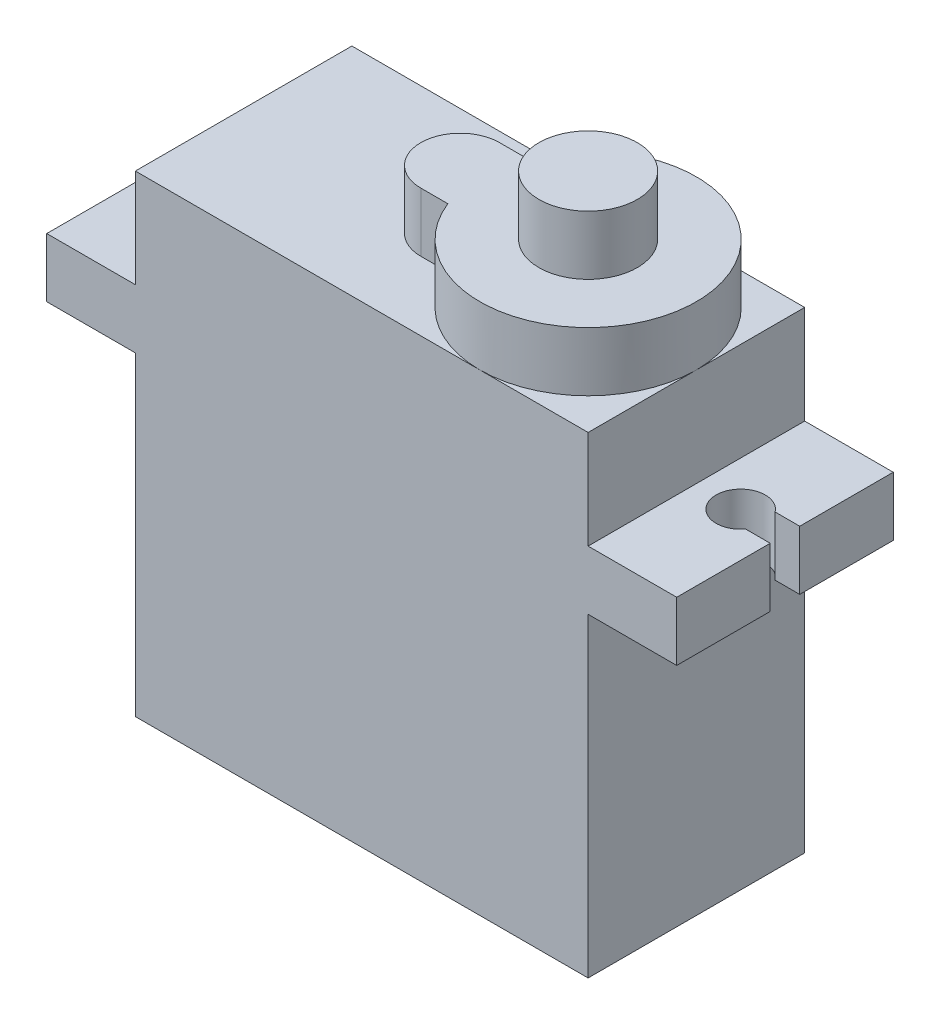
ISO-10303-21;
HEADER;
FILE_DESCRIPTION(('STEP AP214'),'2;1');
FILE_NAME('part.step','',(''),(''),'','','');
FILE_SCHEMA(('AUTOMOTIVE_DESIGN { 1 0 10303 214 1 1 1 1 }'));
ENDSEC;
DATA;
#1=APPLICATION_CONTEXT('core data for automotive mechanical design processes');
#2=APPLICATION_PROTOCOL_DEFINITION('international standard','automotive_design',2000,#1);
#3=PRODUCT_CONTEXT('',#1,'mechanical');
#4=PRODUCT('Part','Part','',(#3));
#5=PRODUCT_RELATED_PRODUCT_CATEGORY('part','',(#4));
#6=PRODUCT_DEFINITION_FORMATION('','',#4);
#7=PRODUCT_DEFINITION_CONTEXT('part definition',#1,'design');
#8=PRODUCT_DEFINITION('design','',#6,#7);
#9=PRODUCT_DEFINITION_SHAPE('','',#8);
#10=(LENGTH_UNIT() NAMED_UNIT(*) SI_UNIT(.MILLI.,.METRE.));
#11=(NAMED_UNIT(*) PLANE_ANGLE_UNIT() SI_UNIT($,.RADIAN.));
#12=(NAMED_UNIT(*) SI_UNIT($,.STERADIAN.) SOLID_ANGLE_UNIT());
#13=UNCERTAINTY_MEASURE_WITH_UNIT(LENGTH_MEASURE(1.E-05),#10,'distance_accuracy_value','');
#14=(GEOMETRIC_REPRESENTATION_CONTEXT(3) GLOBAL_UNCERTAINTY_ASSIGNED_CONTEXT((#13)) GLOBAL_UNIT_ASSIGNED_CONTEXT((#10,
#11,#12)) REPRESENTATION_CONTEXT('',''));
#15=CARTESIAN_POINT('',(0.,0.,0.));
#16=DIRECTION('',(0.,0.,1.));
#17=DIRECTION('',(1.,0.,0.));
#18=AXIS2_PLACEMENT_3D('',#15,#16,#17);
#19=CARTESIAN_POINT('',(-16.,0.,0.));
#20=DIRECTION('',(1.,0.,0.));
#21=DIRECTION('',(0.,0.,-1.));
#22=AXIS2_PLACEMENT_3D('',#19,#20,#21);
#23=PLANE('',#22);
#24=DIRECTION('',(0.,0.,-1.));
#25=VECTOR('',#24,1.);
#26=CARTESIAN_POINT('',(-16.,16.,5.5));
#27=LINE('',#26,#25);
#28=CARTESIAN_POINT('',(-16.,16.,-0.75));
#29=VERTEX_POINT('',#28);
#30=CARTESIAN_POINT('',(-16.,16.,-5.5));
#31=VERTEX_POINT('',#30);
#32=EDGE_CURVE('E309',#29,#31,#27,.T.);
#33=ORIENTED_EDGE('',*,*,#32,.F.);
#34=DIRECTION('',(0.,1.,0.));
#35=VECTOR('',#34,1.);
#36=CARTESIAN_POINT('',(-16.,15.,-0.75));
#37=LINE('',#36,#35);
#38=CARTESIAN_POINT('',(-16.,19.,-0.75));
#39=VERTEX_POINT('',#38);
#40=EDGE_CURVE('E227',#29,#39,#37,.T.);
#41=ORIENTED_EDGE('',*,*,#40,.T.);
#42=DIRECTION('',(0.,0.,1.));
#43=VECTOR('',#42,1.);
#44=CARTESIAN_POINT('',(-16.,19.,5.5));
#45=LINE('',#44,#43);
#46=CARTESIAN_POINT('',(-16.,19.,-5.5));
#47=VERTEX_POINT('',#46);
#48=EDGE_CURVE('E317',#47,#39,#45,.T.);
#49=ORIENTED_EDGE('',*,*,#48,.F.);
#50=DIRECTION('',(0.,1.,0.));
#51=VECTOR('',#50,1.);
#52=CARTESIAN_POINT('',(-16.,19.,-5.5));
#53=LINE('',#52,#51);
#54=EDGE_CURVE('E313',#31,#47,#53,.T.);
#55=ORIENTED_EDGE('',*,*,#54,.F.);
#56=EDGE_LOOP('',(#33,#41,#49,#55));
#57=FACE_BOUND('',#56,.T.);
#58=ADVANCED_FACE('F34',(#57),#23,.F.);
#59=CARTESIAN_POINT('',(16.,0.,0.));
#60=DIRECTION('',(1.,0.,0.));
#61=DIRECTION('',(0.,0.,-1.));
#62=AXIS2_PLACEMENT_3D('',#59,#60,#61);
#63=PLANE('',#62);
#64=DIRECTION('',(0.,1.,0.));
#65=VECTOR('',#64,1.);
#66=CARTESIAN_POINT('',(16.,0.,-0.75));
#67=LINE('',#66,#65);
#68=CARTESIAN_POINT('',(16.,16.,-0.75));
#69=VERTEX_POINT('',#68);
#70=CARTESIAN_POINT('',(16.,19.,-0.75));
#71=VERTEX_POINT('',#70);
#72=EDGE_CURVE('E42',#69,#71,#67,.T.);
#73=ORIENTED_EDGE('',*,*,#72,.F.);
#74=DIRECTION('',(0.,0.,-1.));
#75=VECTOR('',#74,1.);
#76=CARTESIAN_POINT('',(16.,16.,5.5));
#77=LINE('',#76,#75);
#78=CARTESIAN_POINT('',(16.,16.,-5.5));
#79=VERTEX_POINT('',#78);
#80=EDGE_CURVE('E295',#69,#79,#77,.T.);
#81=ORIENTED_EDGE('',*,*,#80,.T.);
#82=DIRECTION('',(0.,1.,0.));
#83=VECTOR('',#82,1.);
#84=CARTESIAN_POINT('',(16.,19.,-5.5));
#85=LINE('',#84,#83);
#86=CARTESIAN_POINT('',(16.,19.,-5.5));
#87=VERTEX_POINT('',#86);
#88=EDGE_CURVE('E299',#79,#87,#85,.T.);
#89=ORIENTED_EDGE('',*,*,#88,.T.);
#90=DIRECTION('',(0.,0.,1.));
#91=VECTOR('',#90,1.);
#92=CARTESIAN_POINT('',(16.,19.,5.5));
#93=LINE('',#92,#91);
#94=EDGE_CURVE('E303',#87,#71,#93,.T.);
#95=ORIENTED_EDGE('',*,*,#94,.T.);
#96=EDGE_LOOP('',(#73,#81,#89,#95));
#97=FACE_BOUND('',#96,.T.);
#98=ADVANCED_FACE('F400',(#97),#63,.T.);
#99=CARTESIAN_POINT('',(0.,24.,0.));
#100=DIRECTION('',(0.,-1.,0.));
#101=DIRECTION('',(0.,0.,-1.));
#102=AXIS2_PLACEMENT_3D('',#99,#100,#101);
#103=PLANE('',#102);
#104=CARTESIAN_POINT('',(6.,24.,0.));
#105=DIRECTION('',(0.,1.,0.));
#106=DIRECTION('',(0.,0.,1.));
#107=AXIS2_PLACEMENT_3D('',#104,#105,#106);
#108=CIRCLE('',#107,5.5);
#109=CARTESIAN_POINT('',(11.5,24.,0.));
#110=VERTEX_POINT('',#109);
#111=CARTESIAN_POINT('',(6.,24.,-5.5));
#112=VERTEX_POINT('',#111);
#113=EDGE_CURVE('E277',#110,#112,#108,.T.);
#114=ORIENTED_EDGE('',*,*,#113,.F.);
#115=DIRECTION('',(0.,0.,-1.));
#116=VECTOR('',#115,1.);
#117=CARTESIAN_POINT('',(11.5,24.,5.5));
#118=LINE('',#117,#116);
#119=CARTESIAN_POINT('',(11.5,24.,-5.5));
#120=VERTEX_POINT('',#119);
#121=EDGE_CURVE('E350',#110,#120,#118,.T.);
#122=ORIENTED_EDGE('',*,*,#121,.T.);
#123=DIRECTION('',(-1.,0.,0.));
#124=VECTOR('',#123,1.);
#125=CARTESIAN_POINT('',(-11.5,24.,-5.5));
#126=LINE('',#125,#124);
#127=EDGE_CURVE('E351',#120,#112,#126,.T.);
#128=ORIENTED_EDGE('',*,*,#127,.T.);
#129=EDGE_LOOP('',(#114,#122,#128));
#130=FACE_BOUND('',#129,.T.);
#131=ADVANCED_FACE('F454',(#130),#103,.F.);
#132=CARTESIAN_POINT('',(0.876524617020201,24.,-2.));
#133=VERTEX_POINT('',#132);
#134=EDGE_CURVE('E520',#112,#133,#108,.T.);
#135=ORIENTED_EDGE('',*,*,#134,.F.);
#136=CARTESIAN_POINT('',(-11.5,24.,-5.5));
#137=VERTEX_POINT('',#136);
#138=EDGE_CURVE('E349',#112,#137,#126,.T.);
#139=ORIENTED_EDGE('',*,*,#138,.T.);
#140=DIRECTION('',(0.,0.,1.));
#141=VECTOR('',#140,1.);
#142=CARTESIAN_POINT('',(-11.5,24.,5.5));
#143=LINE('',#142,#141);
#144=CARTESIAN_POINT('',(-11.5,24.,5.5));
#145=VERTEX_POINT('',#144);
#146=EDGE_CURVE('E354',#137,#145,#143,.T.);
#147=ORIENTED_EDGE('',*,*,#146,.T.);
#148=DIRECTION('',(1.,0.,0.));
#149=VECTOR('',#148,1.);
#150=CARTESIAN_POINT('',(-11.5,24.,5.5));
#151=LINE('',#150,#149);
#152=CARTESIAN_POINT('',(6.,24.,5.5));
#153=VERTEX_POINT('',#152);
#154=EDGE_CURVE('E357',#145,#153,#151,.T.);
#155=ORIENTED_EDGE('',*,*,#154,.T.);
#156=CARTESIAN_POINT('',(0.876524617020201,24.,2.));
#157=VERTEX_POINT('',#156);
#158=EDGE_CURVE('E274',#157,#153,#108,.T.);
#159=ORIENTED_EDGE('',*,*,#158,.F.);
#160=DIRECTION('',(1.,0.,0.));
#161=VECTOR('',#160,1.);
#162=CARTESIAN_POINT('',(-0.5,24.,2.));
#163=LINE('',#162,#161);
#164=CARTESIAN_POINT('',(-0.5,24.,2.));
#165=VERTEX_POINT('',#164);
#166=EDGE_CURVE('E271',#165,#157,#163,.T.);
#167=ORIENTED_EDGE('',*,*,#166,.F.);
#168=CARTESIAN_POINT('',(-0.5,24.,0.));
#169=DIRECTION('',(0.,1.,0.));
#170=DIRECTION('',(0.,0.,1.));
#171=AXIS2_PLACEMENT_3D('',#168,#169,#170);
#172=CIRCLE('',#171,2.);
#173=CARTESIAN_POINT('',(-0.5,24.,-2.));
#174=VERTEX_POINT('',#173);
#175=EDGE_CURVE('E257',#174,#165,#172,.T.);
#176=ORIENTED_EDGE('',*,*,#175,.F.);
#177=DIRECTION('',(-1.,0.,0.));
#178=VECTOR('',#177,1.);
#179=CARTESIAN_POINT('',(-0.5,24.,-2.));
#180=LINE('',#179,#178);
#181=EDGE_CURVE('E262',#133,#174,#180,.T.);
#182=ORIENTED_EDGE('',*,*,#181,.F.);
#183=EDGE_LOOP('',(#135,#139,#147,#155,#159,#167,#176,#182));
#184=FACE_BOUND('',#183,.T.);
#185=ADVANCED_FACE('F501',(#184),#103,.F.);
#186=CARTESIAN_POINT('',(11.5,24.,5.5));
#187=DIRECTION('',(-1.,0.,0.));
#188=DIRECTION('',(0.,0.,1.));
#189=AXIS2_PLACEMENT_3D('',#186,#187,#188);
#190=PLANE('',#189);
#191=DIRECTION('',(0.,-1.,0.));
#192=VECTOR('',#191,1.);
#193=CARTESIAN_POINT('',(11.5,24.,5.5));
#194=LINE('',#193,#192);
#195=CARTESIAN_POINT('',(11.5,24.,5.5));
#196=VERTEX_POINT('',#195);
#197=CARTESIAN_POINT('',(11.5,19.,5.5));
#198=VERTEX_POINT('',#197);
#199=EDGE_CURVE('E372',#196,#198,#194,.T.);
#200=ORIENTED_EDGE('',*,*,#199,.T.);
#201=DIRECTION('',(0.,0.,-1.));
#202=VECTOR('',#201,1.);
#203=CARTESIAN_POINT('',(11.5,19.,5.5));
#204=LINE('',#203,#202);
#205=CARTESIAN_POINT('',(11.5,19.,-5.5));
#206=VERTEX_POINT('',#205);
#207=EDGE_CURVE('E342',#198,#206,#204,.T.);
#208=ORIENTED_EDGE('',*,*,#207,.T.);
#209=DIRECTION('',(0.,-1.,0.));
#210=VECTOR('',#209,1.);
#211=CARTESIAN_POINT('',(11.5,24.,-5.5));
#212=LINE('',#211,#210);
#213=EDGE_CURVE('E384',#120,#206,#212,.T.);
#214=ORIENTED_EDGE('',*,*,#213,.F.);
#215=ORIENTED_EDGE('',*,*,#121,.F.);
#216=EDGE_CURVE('E346',#196,#110,#118,.T.);
#217=ORIENTED_EDGE('',*,*,#216,.F.);
#218=EDGE_LOOP('',(#200,#208,#214,#215,#217));
#219=FACE_BOUND('',#218,.T.);
#220=ADVANCED_FACE('F413',(#219),#190,.F.);
#221=CARTESIAN_POINT('',(-11.5,24.,5.5));
#222=DIRECTION('',(1.,0.,0.));
#223=DIRECTION('',(0.,0.,-1.));
#224=AXIS2_PLACEMENT_3D('',#221,#222,#223);
#225=PLANE('',#224);
#226=DIRECTION('',(0.,-1.,0.));
#227=VECTOR('',#226,1.);
#228=CARTESIAN_POINT('',(-11.5,24.,-5.5));
#229=LINE('',#228,#227);
#230=CARTESIAN_POINT('',(-11.5,19.,-5.5));
#231=VERTEX_POINT('',#230);
#232=EDGE_CURVE('E380',#137,#231,#229,.T.);
#233=ORIENTED_EDGE('',*,*,#232,.T.);
#234=DIRECTION('',(0.,0.,1.));
#235=VECTOR('',#234,1.);
#236=CARTESIAN_POINT('',(-11.5,19.,5.5));
#237=LINE('',#236,#235);
#238=CARTESIAN_POINT('',(-11.5,19.,5.5));
#239=VERTEX_POINT('',#238);
#240=EDGE_CURVE('E339',#231,#239,#237,.T.);
#241=ORIENTED_EDGE('',*,*,#240,.T.);
#242=DIRECTION('',(0.,-1.,0.));
#243=VECTOR('',#242,1.);
#244=CARTESIAN_POINT('',(-11.5,24.,5.5));
#245=LINE('',#244,#243);
#246=EDGE_CURVE('E376',#145,#239,#245,.T.);
#247=ORIENTED_EDGE('',*,*,#246,.F.);
#248=ORIENTED_EDGE('',*,*,#146,.F.);
#249=EDGE_LOOP('',(#233,#241,#247,#248));
#250=FACE_BOUND('',#249,.T.);
#251=ADVANCED_FACE('F477',(#250),#225,.F.);
#252=CARTESIAN_POINT('',(11.5,16.,-5.5));
#253=VERTEX_POINT('',#252);
#254=CARTESIAN_POINT('',(11.5,0.,-5.5));
#255=VERTEX_POINT('',#254);
#256=EDGE_CURVE('E383',#253,#255,#212,.T.);
#257=ORIENTED_EDGE('',*,*,#256,.F.);
#258=DIRECTION('',(0.,0.,1.));
#259=VECTOR('',#258,1.);
#260=CARTESIAN_POINT('',(11.5,16.,5.5));
#261=LINE('',#260,#259);
#262=CARTESIAN_POINT('',(11.5,16.,5.5));
#263=VERTEX_POINT('',#262);
#264=EDGE_CURVE('E336',#253,#263,#261,.T.);
#265=ORIENTED_EDGE('',*,*,#264,.T.);
#266=CARTESIAN_POINT('',(11.5,0.,5.5));
#267=VERTEX_POINT('',#266);
#268=EDGE_CURVE('E360',#263,#267,#194,.T.);
#269=ORIENTED_EDGE('',*,*,#268,.T.);
#270=DIRECTION('',(0.,0.,-1.));
#271=VECTOR('',#270,1.);
#272=CARTESIAN_POINT('',(11.5,0.,5.5));
#273=LINE('',#272,#271);
#274=EDGE_CURVE('E345',#267,#255,#273,.T.);
#275=ORIENTED_EDGE('',*,*,#274,.T.);
#276=EDGE_LOOP('',(#257,#265,#269,#275));
#277=FACE_BOUND('',#276,.T.);
#278=ADVANCED_FACE('F36',(#277),#190,.F.);
#279=CARTESIAN_POINT('',(-11.5,24.,-5.5));
#280=DIRECTION('',(0.,0.,1.));
#281=DIRECTION('',(1.,0.,0.));
#282=AXIS2_PLACEMENT_3D('',#279,#280,#281);
#283=PLANE('',#282);
#284=CARTESIAN_POINT('',(-11.5,16.,-5.5));
#285=VERTEX_POINT('',#284);
#286=CARTESIAN_POINT('',(-11.5,0.,-5.5));
#287=VERTEX_POINT('',#286);
#288=EDGE_CURVE('E379',#285,#287,#229,.T.);
#289=ORIENTED_EDGE('',*,*,#288,.F.);
#290=DIRECTION('',(1.,0.,0.));
#291=VECTOR('',#290,1.);
#292=CARTESIAN_POINT('',(-16.,16.,-5.5));
#293=LINE('',#292,#291);
#294=EDGE_CURVE('E328',#31,#285,#293,.T.);
#295=ORIENTED_EDGE('',*,*,#294,.F.);
#296=ORIENTED_EDGE('',*,*,#54,.T.);
#297=DIRECTION('',(1.,0.,0.));
#298=VECTOR('',#297,1.);
#299=CARTESIAN_POINT('',(-16.,19.,-5.5));
#300=LINE('',#299,#298);
#301=EDGE_CURVE('E324',#47,#231,#300,.T.);
#302=ORIENTED_EDGE('',*,*,#301,.T.);
#303=ORIENTED_EDGE('',*,*,#232,.F.);
#304=ORIENTED_EDGE('',*,*,#138,.F.);
#305=ORIENTED_EDGE('',*,*,#127,.F.);
#306=ORIENTED_EDGE('',*,*,#213,.T.);
#307=EDGE_CURVE('E327',#206,#87,#300,.T.);
#308=ORIENTED_EDGE('',*,*,#307,.T.);
#309=ORIENTED_EDGE('',*,*,#88,.F.);
#310=EDGE_CURVE('E330',#253,#79,#293,.T.);
#311=ORIENTED_EDGE('',*,*,#310,.F.);
#312=ORIENTED_EDGE('',*,*,#256,.T.);
#313=DIRECTION('',(-1.,0.,0.));
#314=VECTOR('',#313,1.);
#315=CARTESIAN_POINT('',(-11.5,0.,-5.5));
#316=LINE('',#315,#314);
#317=EDGE_CURVE('E363',#255,#287,#316,.T.);
#318=ORIENTED_EDGE('',*,*,#317,.T.);
#319=EDGE_LOOP('',(#289,#295,#296,#302,#303,#304,#305,#306,#308,#309,#311,#312,#318));
#320=FACE_BOUND('',#319,.T.);
#321=ADVANCED_FACE('F406',(#320),#283,.F.);
#322=CARTESIAN_POINT('',(-11.5,16.,5.5));
#323=VERTEX_POINT('',#322);
#324=CARTESIAN_POINT('',(-11.5,0.,5.5));
#325=VERTEX_POINT('',#324);
#326=EDGE_CURVE('E375',#323,#325,#245,.T.);
#327=ORIENTED_EDGE('',*,*,#326,.F.);
#328=DIRECTION('',(0.,0.,-1.));
#329=VECTOR('',#328,1.);
#330=CARTESIAN_POINT('',(-11.5,16.,5.5));
#331=LINE('',#330,#329);
#332=EDGE_CURVE('E322',#323,#285,#331,.T.);
#333=ORIENTED_EDGE('',*,*,#332,.T.);
#334=ORIENTED_EDGE('',*,*,#288,.T.);
#335=DIRECTION('',(0.,0.,1.));
#336=VECTOR('',#335,1.);
#337=CARTESIAN_POINT('',(-11.5,0.,5.5));
#338=LINE('',#337,#336);
#339=EDGE_CURVE('E366',#287,#325,#338,.T.);
#340=ORIENTED_EDGE('',*,*,#339,.T.);
#341=EDGE_LOOP('',(#327,#333,#334,#340));
#342=FACE_BOUND('',#341,.T.);
#343=ADVANCED_FACE('F488',(#342),#225,.F.);
#344=CARTESIAN_POINT('',(-11.5,24.,5.5));
#345=DIRECTION('',(0.,0.,-1.));
#346=DIRECTION('',(-1.,0.,0.));
#347=AXIS2_PLACEMENT_3D('',#344,#345,#346);
#348=PLANE('',#347);
#349=ORIENTED_EDGE('',*,*,#268,.F.);
#350=DIRECTION('',(1.,0.,0.));
#351=VECTOR('',#350,1.);
#352=CARTESIAN_POINT('',(-16.,16.,5.5));
#353=LINE('',#352,#351);
#354=CARTESIAN_POINT('',(16.,16.,5.5));
#355=VERTEX_POINT('',#354);
#356=EDGE_CURVE('E319',#263,#355,#353,.T.);
#357=ORIENTED_EDGE('',*,*,#356,.T.);
#358=DIRECTION('',(0.,-1.,0.));
#359=VECTOR('',#358,1.);
#360=CARTESIAN_POINT('',(16.,19.,5.5));
#361=LINE('',#360,#359);
#362=CARTESIAN_POINT('',(16.,19.,5.5));
#363=VERTEX_POINT('',#362);
#364=EDGE_CURVE('E292',#363,#355,#361,.T.);
#365=ORIENTED_EDGE('',*,*,#364,.F.);
#366=DIRECTION('',(1.,0.,0.));
#367=VECTOR('',#366,1.);
#368=CARTESIAN_POINT('',(-16.,19.,5.5));
#369=LINE('',#368,#367);
#370=EDGE_CURVE('E323',#198,#363,#369,.T.);
#371=ORIENTED_EDGE('',*,*,#370,.F.);
#372=ORIENTED_EDGE('',*,*,#199,.F.);
#373=EDGE_CURVE('E356',#153,#196,#151,.T.);
#374=ORIENTED_EDGE('',*,*,#373,.F.);
#375=ORIENTED_EDGE('',*,*,#154,.F.);
#376=ORIENTED_EDGE('',*,*,#246,.T.);
#377=CARTESIAN_POINT('',(-16.,19.,5.5));
#378=VERTEX_POINT('',#377);
#379=EDGE_CURVE('E320',#378,#239,#369,.T.);
#380=ORIENTED_EDGE('',*,*,#379,.F.);
#381=DIRECTION('',(0.,-1.,0.));
#382=VECTOR('',#381,1.);
#383=CARTESIAN_POINT('',(-16.,19.,5.5));
#384=LINE('',#383,#382);
#385=CARTESIAN_POINT('',(-16.,16.,5.5));
#386=VERTEX_POINT('',#385);
#387=EDGE_CURVE('E306',#378,#386,#384,.T.);
#388=ORIENTED_EDGE('',*,*,#387,.T.);
#389=EDGE_CURVE('E331',#386,#323,#353,.T.);
#390=ORIENTED_EDGE('',*,*,#389,.T.);
#391=ORIENTED_EDGE('',*,*,#326,.T.);
#392=DIRECTION('',(1.,0.,0.));
#393=VECTOR('',#392,1.);
#394=CARTESIAN_POINT('',(-11.5,0.,5.5));
#395=LINE('',#394,#393);
#396=EDGE_CURVE('E369',#325,#267,#395,.T.);
#397=ORIENTED_EDGE('',*,*,#396,.T.);
#398=EDGE_LOOP('',(#349,#357,#365,#371,#372,#374,#375,#376,#380,#388,#390,#391,#397));
#399=FACE_BOUND('',#398,.T.);
#400=ADVANCED_FACE('F420',(#399),#348,.F.);
#401=EDGE_CURVE('E278',#153,#110,#108,.T.);
#402=ORIENTED_EDGE('',*,*,#401,.F.);
#403=ORIENTED_EDGE('',*,*,#373,.T.);
#404=ORIENTED_EDGE('',*,*,#216,.T.);
#405=EDGE_LOOP('',(#402,#403,#404));
#406=FACE_BOUND('',#405,.T.);
#407=ADVANCED_FACE('F468',(#406),#103,.F.);
#408=CARTESIAN_POINT('',(0.,0.,0.));
#409=DIRECTION('',(0.,-1.,0.));
#410=DIRECTION('',(0.,0.,-1.));
#411=AXIS2_PLACEMENT_3D('',#408,#409,#410);
#412=PLANE('',#411);
#413=ORIENTED_EDGE('',*,*,#274,.F.);
#414=ORIENTED_EDGE('',*,*,#396,.F.);
#415=ORIENTED_EDGE('',*,*,#339,.F.);
#416=ORIENTED_EDGE('',*,*,#317,.F.);
#417=EDGE_LOOP('',(#413,#414,#415,#416));
#418=FACE_BOUND('',#417,.T.);
#419=ADVANCED_FACE('F460',(#418),#412,.T.);
#420=CARTESIAN_POINT('',(-16.,19.,0.75));
#421=VERTEX_POINT('',#420);
#422=EDGE_CURVE('E316',#421,#378,#45,.T.);
#423=ORIENTED_EDGE('',*,*,#422,.F.);
#424=DIRECTION('',(0.,1.,0.));
#425=VECTOR('',#424,1.);
#426=CARTESIAN_POINT('',(-16.,15.,0.75));
#427=LINE('',#426,#425);
#428=CARTESIAN_POINT('',(-16.,16.,0.75));
#429=VERTEX_POINT('',#428);
#430=EDGE_CURVE('E49',#429,#421,#427,.T.);
#431=ORIENTED_EDGE('',*,*,#430,.F.);
#432=EDGE_CURVE('E310',#386,#429,#27,.T.);
#433=ORIENTED_EDGE('',*,*,#432,.F.);
#434=ORIENTED_EDGE('',*,*,#387,.F.);
#435=EDGE_LOOP('',(#423,#431,#433,#434));
#436=FACE_BOUND('',#435,.T.);
#437=ADVANCED_FACE('F450',(#436),#23,.F.);
#438=CARTESIAN_POINT('',(-16.,16.,5.5));
#439=DIRECTION('',(0.,-1.,0.));
#440=DIRECTION('',(0.,0.,-1.));
#441=AXIS2_PLACEMENT_3D('',#438,#439,#440);
#442=PLANE('',#441);
#443=DIRECTION('',(1.,0.,0.));
#444=VECTOR('',#443,1.);
#445=CARTESIAN_POINT('',(-16.,16.,-0.75));
#446=LINE('',#445,#444);
#447=CARTESIAN_POINT('',(-14.75,16.,-0.750000000000001));
#448=VERTEX_POINT('',#447);
#449=EDGE_CURVE('E249',#29,#448,#446,.T.);
#450=ORIENTED_EDGE('',*,*,#449,.F.);
#451=ORIENTED_EDGE('',*,*,#32,.T.);
#452=ORIENTED_EDGE('',*,*,#294,.T.);
#453=ORIENTED_EDGE('',*,*,#332,.F.);
#454=ORIENTED_EDGE('',*,*,#389,.F.);
#455=ORIENTED_EDGE('',*,*,#432,.T.);
#456=DIRECTION('',(-1.,0.,0.));
#457=VECTOR('',#456,1.);
#458=CARTESIAN_POINT('',(-16.,16.,0.75));
#459=LINE('',#458,#457);
#460=CARTESIAN_POINT('',(-14.75,16.,0.75));
#461=VERTEX_POINT('',#460);
#462=EDGE_CURVE('E246',#461,#429,#459,.T.);
#463=ORIENTED_EDGE('',*,*,#462,.F.);
#464=CARTESIAN_POINT('',(-13.75,16.,0.));
#465=DIRECTION('',(0.,-1.,0.));
#466=DIRECTION('',(0.,0.,-1.));
#467=AXIS2_PLACEMENT_3D('',#464,#465,#466);
#468=CIRCLE('',#467,1.25);
#469=EDGE_CURVE('E211',#448,#461,#468,.T.);
#470=ORIENTED_EDGE('',*,*,#469,.F.);
#471=EDGE_LOOP('',(#450,#451,#452,#453,#454,#455,#463,#470));
#472=FACE_BOUND('',#471,.T.);
#473=ADVANCED_FACE('F459',(#472),#442,.T.);
#474=CARTESIAN_POINT('',(-16.,19.,5.5));
#475=DIRECTION('',(0.,1.,0.));
#476=DIRECTION('',(0.,0.,1.));
#477=AXIS2_PLACEMENT_3D('',#474,#475,#476);
#478=PLANE('',#477);
#479=DIRECTION('',(-1.,0.,0.));
#480=VECTOR('',#479,1.);
#481=CARTESIAN_POINT('',(-14.75,19.,-0.75));
#482=LINE('',#481,#480);
#483=CARTESIAN_POINT('',(-14.75,19.,-0.750000000000001));
#484=VERTEX_POINT('',#483);
#485=EDGE_CURVE('E223',#484,#39,#482,.T.);
#486=ORIENTED_EDGE('',*,*,#485,.F.);
#487=CARTESIAN_POINT('',(-13.75,19.,0.));
#488=DIRECTION('',(0.,1.,0.));
#489=DIRECTION('',(0.,0.,1.));
#490=AXIS2_PLACEMENT_3D('',#487,#488,#489);
#491=CIRCLE('',#490,1.25);
#492=CARTESIAN_POINT('',(-14.75,19.,0.75));
#493=VERTEX_POINT('',#492);
#494=EDGE_CURVE('E208',#493,#484,#491,.T.);
#495=ORIENTED_EDGE('',*,*,#494,.F.);
#496=DIRECTION('',(1.,0.,0.));
#497=VECTOR('',#496,1.);
#498=CARTESIAN_POINT('',(-16.,19.,0.75));
#499=LINE('',#498,#497);
#500=EDGE_CURVE('E215',#421,#493,#499,.T.);
#501=ORIENTED_EDGE('',*,*,#500,.F.);
#502=ORIENTED_EDGE('',*,*,#422,.T.);
#503=ORIENTED_EDGE('',*,*,#379,.T.);
#504=ORIENTED_EDGE('',*,*,#240,.F.);
#505=ORIENTED_EDGE('',*,*,#301,.F.);
#506=ORIENTED_EDGE('',*,*,#48,.T.);
#507=EDGE_LOOP('',(#486,#495,#501,#502,#503,#504,#505,#506));
#508=FACE_BOUND('',#507,.T.);
#509=ADVANCED_FACE('F221',(#508),#478,.T.);
#510=DIRECTION('',(-1.,0.,0.));
#511=VECTOR('',#510,1.);
#512=CARTESIAN_POINT('',(14.75,19.,-0.75));
#513=LINE('',#512,#511);
#514=CARTESIAN_POINT('',(14.75,19.,-0.75));
#515=VERTEX_POINT('',#514);
#516=EDGE_CURVE('E237',#71,#515,#513,.T.);
#517=ORIENTED_EDGE('',*,*,#516,.F.);
#518=ORIENTED_EDGE('',*,*,#94,.F.);
#519=ORIENTED_EDGE('',*,*,#307,.F.);
#520=ORIENTED_EDGE('',*,*,#207,.F.);
#521=ORIENTED_EDGE('',*,*,#370,.T.);
#522=CARTESIAN_POINT('',(16.,19.,0.75));
#523=VERTEX_POINT('',#522);
#524=EDGE_CURVE('E302',#523,#363,#93,.T.);
#525=ORIENTED_EDGE('',*,*,#524,.F.);
#526=DIRECTION('',(1.,0.,0.));
#527=VECTOR('',#526,1.);
#528=CARTESIAN_POINT('',(16.,19.,0.75));
#529=LINE('',#528,#527);
#530=CARTESIAN_POINT('',(14.75,19.,0.75));
#531=VERTEX_POINT('',#530);
#532=EDGE_CURVE('E57',#531,#523,#529,.T.);
#533=ORIENTED_EDGE('',*,*,#532,.F.);
#534=CARTESIAN_POINT('',(13.75,19.,0.));
#535=DIRECTION('',(0.,1.,0.));
#536=DIRECTION('',(0.,0.,1.));
#537=AXIS2_PLACEMENT_3D('',#534,#535,#536);
#538=CIRCLE('',#537,1.25);
#539=EDGE_CURVE('E233',#515,#531,#538,.T.);
#540=ORIENTED_EDGE('',*,*,#539,.F.);
#541=EDGE_LOOP('',(#517,#518,#519,#520,#521,#525,#533,#540));
#542=FACE_BOUND('',#541,.T.);
#543=ADVANCED_FACE('F399',(#542),#478,.T.);
#544=DIRECTION('',(1.,0.,0.));
#545=VECTOR('',#544,1.);
#546=CARTESIAN_POINT('',(-16.,16.,-0.750000000000002));
#547=LINE('',#546,#545);
#548=CARTESIAN_POINT('',(14.75,16.,-0.75));
#549=VERTEX_POINT('',#548);
#550=EDGE_CURVE('E244',#549,#69,#547,.T.);
#551=ORIENTED_EDGE('',*,*,#550,.F.);
#552=CARTESIAN_POINT('',(13.75,16.,0.));
#553=DIRECTION('',(0.,-1.,0.));
#554=DIRECTION('',(0.,0.,-1.));
#555=AXIS2_PLACEMENT_3D('',#552,#553,#554);
#556=CIRCLE('',#555,1.25);
#557=CARTESIAN_POINT('',(14.75,16.,0.75));
#558=VERTEX_POINT('',#557);
#559=EDGE_CURVE('E11',#558,#549,#556,.T.);
#560=ORIENTED_EDGE('',*,*,#559,.F.);
#561=DIRECTION('',(-1.,0.,0.));
#562=VECTOR('',#561,1.);
#563=CARTESIAN_POINT('',(-16.,16.,0.750000000000002));
#564=LINE('',#563,#562);
#565=CARTESIAN_POINT('',(16.,16.,0.75));
#566=VERTEX_POINT('',#565);
#567=EDGE_CURVE('E230',#566,#558,#564,.T.);
#568=ORIENTED_EDGE('',*,*,#567,.F.);
#569=EDGE_CURVE('E296',#355,#566,#77,.T.);
#570=ORIENTED_EDGE('',*,*,#569,.F.);
#571=ORIENTED_EDGE('',*,*,#356,.F.);
#572=ORIENTED_EDGE('',*,*,#264,.F.);
#573=ORIENTED_EDGE('',*,*,#310,.T.);
#574=ORIENTED_EDGE('',*,*,#80,.F.);
#575=EDGE_LOOP('',(#551,#560,#568,#570,#571,#572,#573,#574));
#576=FACE_BOUND('',#575,.T.);
#577=ADVANCED_FACE('F432',(#576),#442,.T.);
#578=DIRECTION('',(0.,-1.,0.));
#579=VECTOR('',#578,1.);
#580=CARTESIAN_POINT('',(16.,0.,0.75));
#581=LINE('',#580,#579);
#582=EDGE_CURVE('E387',#523,#566,#581,.T.);
#583=ORIENTED_EDGE('',*,*,#582,.F.);
#584=ORIENTED_EDGE('',*,*,#524,.T.);
#585=ORIENTED_EDGE('',*,*,#364,.T.);
#586=ORIENTED_EDGE('',*,*,#569,.T.);
#587=EDGE_LOOP('',(#583,#584,#585,#586));
#588=FACE_BOUND('',#587,.T.);
#589=ADVANCED_FACE('F425',(#588),#63,.T.);
#590=CARTESIAN_POINT('',(-0.5,27.,0.));
#591=DIRECTION('',(0.,1.,0.));
#592=DIRECTION('',(0.,0.,1.));
#593=AXIS2_PLACEMENT_3D('',#590,#591,#592);
#594=PLANE('',#593);
#595=CARTESIAN_POINT('',(-0.5,27.,0.));
#596=DIRECTION('',(0.,1.,0.));
#597=DIRECTION('',(0.,0.,1.));
#598=AXIS2_PLACEMENT_3D('',#595,#596,#597);
#599=CIRCLE('',#598,2.);
#600=CARTESIAN_POINT('',(-0.5,27.,-2.));
#601=VERTEX_POINT('',#600);
#602=CARTESIAN_POINT('',(-0.5,27.,2.));
#603=VERTEX_POINT('',#602);
#604=EDGE_CURVE('E258',#601,#603,#599,.T.);
#605=ORIENTED_EDGE('',*,*,#604,.T.);
#606=DIRECTION('',(1.,0.,0.));
#607=VECTOR('',#606,1.);
#608=CARTESIAN_POINT('',(-0.5,27.,2.));
#609=LINE('',#608,#607);
#610=CARTESIAN_POINT('',(0.876524617020201,27.,2.));
#611=VERTEX_POINT('',#610);
#612=EDGE_CURVE('E261',#603,#611,#609,.T.);
#613=ORIENTED_EDGE('',*,*,#612,.T.);
#614=CARTESIAN_POINT('',(6.,27.,0.));
#615=DIRECTION('',(0.,1.,0.));
#616=DIRECTION('',(0.,0.,1.));
#617=AXIS2_PLACEMENT_3D('',#614,#615,#616);
#618=CIRCLE('',#617,5.5);
#619=CARTESIAN_POINT('',(0.876524617020201,27.,-2.));
#620=VERTEX_POINT('',#619);
#621=EDGE_CURVE('E264',#611,#620,#618,.T.);
#622=ORIENTED_EDGE('',*,*,#621,.T.);
#623=DIRECTION('',(-1.,0.,0.));
#624=VECTOR('',#623,1.);
#625=CARTESIAN_POINT('',(-0.5,27.,-2.));
#626=LINE('',#625,#624);
#627=EDGE_CURVE('E266',#620,#601,#626,.T.);
#628=ORIENTED_EDGE('',*,*,#627,.T.);
#629=EDGE_LOOP('',(#605,#613,#622,#628));
#630=FACE_BOUND('',#629,.T.);
#631=CARTESIAN_POINT('',(6.,27.,0.));
#632=DIRECTION('',(0.,1.,0.));
#633=DIRECTION('',(0.,0.,1.));
#634=AXIS2_PLACEMENT_3D('',#631,#632,#633);
#635=CIRCLE('',#634,2.5);
#636=CARTESIAN_POINT('',(6.,27.,2.5));
#637=VERTEX_POINT('',#636);
#638=EDGE_CURVE('E254',#637,#637,#635,.T.);
#639=ORIENTED_EDGE('',*,*,#638,.F.);
#640=EDGE_LOOP('',(#639));
#641=FACE_BOUND('',#640,.T.);
#642=ADVANCED_FACE('F533',(#630,#641),#594,.T.);
#643=CARTESIAN_POINT('',(-0.5,27.,0.));
#644=DIRECTION('',(0.,-1.,0.));
#645=DIRECTION('',(0.,0.,-1.));
#646=AXIS2_PLACEMENT_3D('',#643,#644,#645);
#647=CYLINDRICAL_SURFACE('',#646,2.);
#648=ORIENTED_EDGE('',*,*,#175,.T.);
#649=DIRECTION('',(0.,-1.,0.));
#650=VECTOR('',#649,1.);
#651=CARTESIAN_POINT('',(-0.5,27.,2.));
#652=LINE('',#651,#650);
#653=EDGE_CURVE('E289',#603,#165,#652,.T.);
#654=ORIENTED_EDGE('',*,*,#653,.F.);
#655=ORIENTED_EDGE('',*,*,#604,.F.);
#656=DIRECTION('',(0.,-1.,0.));
#657=VECTOR('',#656,1.);
#658=CARTESIAN_POINT('',(-0.5,27.,-2.));
#659=LINE('',#658,#657);
#660=EDGE_CURVE('E268',#601,#174,#659,.T.);
#661=ORIENTED_EDGE('',*,*,#660,.T.);
#662=EDGE_LOOP('',(#648,#654,#655,#661));
#663=FACE_BOUND('',#662,.T.);
#664=ADVANCED_FACE('F530',(#663),#647,.T.);
#665=CARTESIAN_POINT('',(-0.5,27.,2.));
#666=DIRECTION('',(0.,0.,-1.));
#667=DIRECTION('',(-1.,0.,0.));
#668=AXIS2_PLACEMENT_3D('',#665,#666,#667);
#669=PLANE('',#668);
#670=ORIENTED_EDGE('',*,*,#166,.T.);
#671=DIRECTION('',(0.,-1.,0.));
#672=VECTOR('',#671,1.);
#673=CARTESIAN_POINT('',(0.876524617020201,27.,2.));
#674=LINE('',#673,#672);
#675=EDGE_CURVE('E286',#611,#157,#674,.T.);
#676=ORIENTED_EDGE('',*,*,#675,.F.);
#677=ORIENTED_EDGE('',*,*,#612,.F.);
#678=ORIENTED_EDGE('',*,*,#653,.T.);
#679=EDGE_LOOP('',(#670,#676,#677,#678));
#680=FACE_BOUND('',#679,.T.);
#681=ADVANCED_FACE('F538',(#680),#669,.F.);
#682=CARTESIAN_POINT('',(6.,27.,0.));
#683=DIRECTION('',(0.,-1.,0.));
#684=DIRECTION('',(0.,0.,-1.));
#685=AXIS2_PLACEMENT_3D('',#682,#683,#684);
#686=CYLINDRICAL_SURFACE('',#685,5.5);
#687=ORIENTED_EDGE('',*,*,#158,.T.);
#688=ORIENTED_EDGE('',*,*,#401,.T.);
#689=ORIENTED_EDGE('',*,*,#113,.T.);
#690=ORIENTED_EDGE('',*,*,#134,.T.);
#691=DIRECTION('',(0.,-1.,0.));
#692=VECTOR('',#691,1.);
#693=CARTESIAN_POINT('',(0.876524617020201,27.,-2.));
#694=LINE('',#693,#692);
#695=EDGE_CURVE('E283',#620,#133,#694,.T.);
#696=ORIENTED_EDGE('',*,*,#695,.F.);
#697=ORIENTED_EDGE('',*,*,#621,.F.);
#698=ORIENTED_EDGE('',*,*,#675,.T.);
#699=EDGE_LOOP('',(#687,#688,#689,#690,#696,#697,#698));
#700=FACE_BOUND('',#699,.T.);
#701=ADVANCED_FACE('F523',(#700),#686,.T.);
#702=CARTESIAN_POINT('',(-0.5,27.,-2.));
#703=DIRECTION('',(0.,0.,1.));
#704=DIRECTION('',(1.,0.,0.));
#705=AXIS2_PLACEMENT_3D('',#702,#703,#704);
#706=PLANE('',#705);
#707=ORIENTED_EDGE('',*,*,#181,.T.);
#708=ORIENTED_EDGE('',*,*,#660,.F.);
#709=ORIENTED_EDGE('',*,*,#627,.F.);
#710=ORIENTED_EDGE('',*,*,#695,.T.);
#711=EDGE_LOOP('',(#707,#708,#709,#710));
#712=FACE_BOUND('',#711,.T.);
#713=ADVANCED_FACE('F526',(#712),#706,.F.);
#714=CARTESIAN_POINT('',(6.,16.9289321881345,0.));
#715=DIRECTION('',(0.,1.,0.));
#716=DIRECTION('',(0.,0.,1.));
#717=AXIS2_PLACEMENT_3D('',#714,#715,#716);
#718=CYLINDRICAL_SURFACE('',#717,2.5);
#719=ORIENTED_EDGE('',*,*,#638,.T.);
#720=EDGE_LOOP('',(#719));
#721=FACE_BOUND('',#720,.T.);
#722=CARTESIAN_POINT('',(6.,30.,0.));
#723=DIRECTION('',(0.,1.,0.));
#724=DIRECTION('',(0.,0.,1.));
#725=AXIS2_PLACEMENT_3D('',#722,#723,#724);
#726=CIRCLE('',#725,2.5);
#727=CARTESIAN_POINT('',(6.,30.,2.5));
#728=VERTEX_POINT('',#727);
#729=EDGE_CURVE('E251',#728,#728,#726,.T.);
#730=ORIENTED_EDGE('',*,*,#729,.F.);
#731=EDGE_LOOP('',(#730));
#732=FACE_BOUND('',#731,.T.);
#733=ADVANCED_FACE('F443',(#721,#732),#718,.T.);
#734=CARTESIAN_POINT('',(6.,30.,0.));
#735=DIRECTION('',(0.,1.,0.));
#736=DIRECTION('',(0.,0.,1.));
#737=AXIS2_PLACEMENT_3D('',#734,#735,#736);
#738=PLANE('',#737);
#739=ORIENTED_EDGE('',*,*,#729,.T.);
#740=EDGE_LOOP('',(#739));
#741=FACE_BOUND('',#740,.T.);
#742=ADVANCED_FACE('F436',(#741),#738,.T.);
#743=CARTESIAN_POINT('',(13.75,15.,0.));
#744=DIRECTION('',(0.,1.,0.));
#745=DIRECTION('',(0.,0.,1.));
#746=AXIS2_PLACEMENT_3D('',#743,#744,#745);
#747=CYLINDRICAL_SURFACE('',#746,1.25);
#748=ORIENTED_EDGE('',*,*,#559,.T.);
#749=DIRECTION('',(0.,1.,0.));
#750=VECTOR('',#749,1.);
#751=CARTESIAN_POINT('',(14.75,15.,-0.75));
#752=LINE('',#751,#750);
#753=EDGE_CURVE('E219',#549,#515,#752,.T.);
#754=ORIENTED_EDGE('',*,*,#753,.T.);
#755=ORIENTED_EDGE('',*,*,#539,.T.);
#756=DIRECTION('',(0.,1.,0.));
#757=VECTOR('',#756,1.);
#758=CARTESIAN_POINT('',(14.75,15.,0.75));
#759=LINE('',#758,#757);
#760=EDGE_CURVE('E240',#558,#531,#759,.T.);
#761=ORIENTED_EDGE('',*,*,#760,.F.);
#762=EDGE_LOOP('',(#748,#754,#755,#761));
#763=FACE_BOUND('',#762,.T.);
#764=ADVANCED_FACE('F434',(#763),#747,.F.);
#765=CARTESIAN_POINT('',(14.75,15.,-0.75));
#766=DIRECTION('',(0.,0.,-1.));
#767=DIRECTION('',(-1.,0.,0.));
#768=AXIS2_PLACEMENT_3D('',#765,#766,#767);
#769=PLANE('',#768);
#770=ORIENTED_EDGE('',*,*,#550,.T.);
#771=ORIENTED_EDGE('',*,*,#72,.T.);
#772=ORIENTED_EDGE('',*,*,#516,.T.);
#773=ORIENTED_EDGE('',*,*,#753,.F.);
#774=EDGE_LOOP('',(#770,#771,#772,#773));
#775=FACE_BOUND('',#774,.T.);
#776=ADVANCED_FACE('F391',(#775),#769,.F.);
#777=CARTESIAN_POINT('',(16.,15.,0.75));
#778=DIRECTION('',(0.,0.,1.));
#779=DIRECTION('',(1.,0.,0.));
#780=AXIS2_PLACEMENT_3D('',#777,#778,#779);
#781=PLANE('',#780);
#782=ORIENTED_EDGE('',*,*,#567,.T.);
#783=ORIENTED_EDGE('',*,*,#760,.T.);
#784=ORIENTED_EDGE('',*,*,#532,.T.);
#785=ORIENTED_EDGE('',*,*,#582,.T.);
#786=EDGE_LOOP('',(#782,#783,#784,#785));
#787=FACE_BOUND('',#786,.T.);
#788=ADVANCED_FACE('F428',(#787),#781,.F.);
#789=CARTESIAN_POINT('',(-14.75,15.,-0.75));
#790=DIRECTION('',(0.,0.,-1.));
#791=DIRECTION('',(-1.,0.,0.));
#792=AXIS2_PLACEMENT_3D('',#789,#790,#791);
#793=PLANE('',#792);
#794=ORIENTED_EDGE('',*,*,#449,.T.);
#795=DIRECTION('',(0.,1.,0.));
#796=VECTOR('',#795,1.);
#797=CARTESIAN_POINT('',(-14.75,15.,-0.750000000000001));
#798=LINE('',#797,#796);
#799=EDGE_CURVE('E213',#448,#484,#798,.T.);
#800=ORIENTED_EDGE('',*,*,#799,.T.);
#801=ORIENTED_EDGE('',*,*,#485,.T.);
#802=ORIENTED_EDGE('',*,*,#40,.F.);
#803=EDGE_LOOP('',(#794,#800,#801,#802));
#804=FACE_BOUND('',#803,.T.);
#805=ADVANCED_FACE('F485',(#804),#793,.F.);
#806=CARTESIAN_POINT('',(-13.75,15.,0.));
#807=DIRECTION('',(0.,1.,0.));
#808=DIRECTION('',(0.,0.,1.));
#809=AXIS2_PLACEMENT_3D('',#806,#807,#808);
#810=CYLINDRICAL_SURFACE('',#809,1.25);
#811=ORIENTED_EDGE('',*,*,#469,.T.);
#812=DIRECTION('',(0.,1.,0.));
#813=VECTOR('',#812,1.);
#814=CARTESIAN_POINT('',(-14.75,15.,0.75));
#815=LINE('',#814,#813);
#816=EDGE_CURVE('E204',#461,#493,#815,.T.);
#817=ORIENTED_EDGE('',*,*,#816,.T.);
#818=ORIENTED_EDGE('',*,*,#494,.T.);
#819=ORIENTED_EDGE('',*,*,#799,.F.);
#820=EDGE_LOOP('',(#811,#817,#818,#819));
#821=FACE_BOUND('',#820,.T.);
#822=ADVANCED_FACE('F205',(#821),#810,.F.);
#823=CARTESIAN_POINT('',(-16.,15.,0.75));
#824=DIRECTION('',(0.,0.,1.));
#825=DIRECTION('',(1.,0.,0.));
#826=AXIS2_PLACEMENT_3D('',#823,#824,#825);
#827=PLANE('',#826);
#828=ORIENTED_EDGE('',*,*,#462,.T.);
#829=ORIENTED_EDGE('',*,*,#430,.T.);
#830=ORIENTED_EDGE('',*,*,#500,.T.);
#831=ORIENTED_EDGE('',*,*,#816,.F.);
#832=EDGE_LOOP('',(#828,#829,#830,#831));
#833=FACE_BOUND('',#832,.T.);
#834=ADVANCED_FACE('F216',(#833),#827,.F.);
#835=CLOSED_SHELL('',(#58,#98,#131,#185,#220,#251,#278,#321,#343,#400,#407,#419,#437,#473,#509,
#543,#577,#589,#642,#664,#681,#701,#713,#733,#742,#764,#776,#788,#805,#822,#834));
#836=MANIFOLD_SOLID_BREP('B2',#835);
#837=ADVANCED_BREP_SHAPE_REPRESENTATION('',(#18,#836),#14);
#838=SHAPE_DEFINITION_REPRESENTATION(#9,#837);
ENDSEC;
END-ISO-10303-21;
